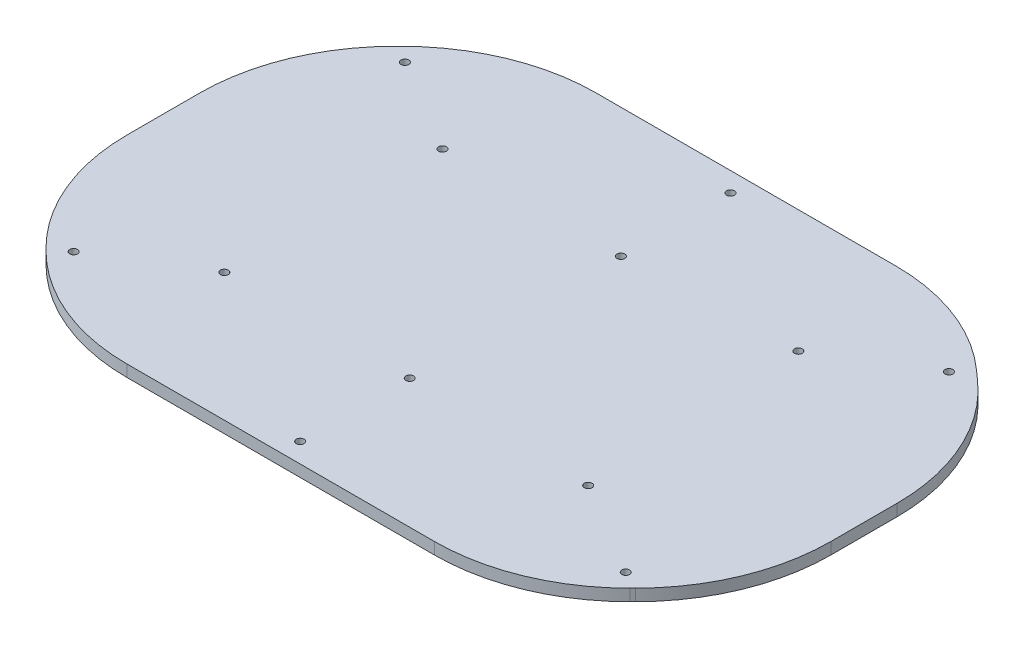
ISO-10303-21;
HEADER;
FILE_DESCRIPTION(('STEP AP214'),'2;1');
FILE_NAME('part.step','',(''),(''),'','','');
FILE_SCHEMA(('AUTOMOTIVE_DESIGN { 1 0 10303 214 1 1 1 1 }'));
ENDSEC;
DATA;
#1=APPLICATION_CONTEXT('core data for automotive mechanical design processes');
#2=APPLICATION_PROTOCOL_DEFINITION('international standard','automotive_design',2000,#1);
#3=PRODUCT_CONTEXT('',#1,'mechanical');
#4=PRODUCT('Part','Part','',(#3));
#5=PRODUCT_RELATED_PRODUCT_CATEGORY('part','',(#4));
#6=PRODUCT_DEFINITION_FORMATION('','',#4);
#7=PRODUCT_DEFINITION_CONTEXT('part definition',#1,'design');
#8=PRODUCT_DEFINITION('design','',#6,#7);
#9=PRODUCT_DEFINITION_SHAPE('','',#8);
#10=(LENGTH_UNIT() NAMED_UNIT(*) SI_UNIT(.MILLI.,.METRE.));
#11=(NAMED_UNIT(*) PLANE_ANGLE_UNIT() SI_UNIT($,.RADIAN.));
#12=(NAMED_UNIT(*) SI_UNIT($,.STERADIAN.) SOLID_ANGLE_UNIT());
#13=UNCERTAINTY_MEASURE_WITH_UNIT(LENGTH_MEASURE(1.E-05),#10,'distance_accuracy_value','');
#14=(GEOMETRIC_REPRESENTATION_CONTEXT(3) GLOBAL_UNCERTAINTY_ASSIGNED_CONTEXT((#13)) GLOBAL_UNIT_ASSIGNED_CONTEXT((#10,
#11,#12)) REPRESENTATION_CONTEXT('',''));
#15=CARTESIAN_POINT('',(0.,0.,0.));
#16=DIRECTION('',(0.,0.,1.));
#17=DIRECTION('',(1.,0.,0.));
#18=AXIS2_PLACEMENT_3D('',#15,#16,#17);
#19=CARTESIAN_POINT('',(77.0344992060901,3.,59.3831452297099));
#20=DIRECTION('',(0.,-1.,0.));
#21=DIRECTION('',(0.,0.,-1.));
#22=AXIS2_PLACEMENT_3D('',#19,#20,#21);
#23=CYLINDRICAL_SURFACE('',#22,49.9999999999996);
#24=CARTESIAN_POINT('',(77.0344992060901,0.,59.3831452297099));
#25=DIRECTION('',(0.,1.,0.));
#26=DIRECTION('',(0.,0.,1.));
#27=AXIS2_PLACEMENT_3D('',#24,#25,#26);
#28=CIRCLE('',#27,49.9999999999996);
#29=CARTESIAN_POINT('',(27.0344992060906,0.,59.3831452297099));
#30=VERTEX_POINT('',#29);
#31=CARTESIAN_POINT('',(41.679160146763,0.,24.0278061703827));
#32=VERTEX_POINT('',#31);
#33=EDGE_CURVE('E183',#30,#32,#28,.F.);
#34=ORIENTED_EDGE('',*,*,#33,.F.);
#35=DIRECTION('',(0.,-1.,0.));
#36=VECTOR('',#35,1.);
#37=CARTESIAN_POINT('',(27.0344992060906,3.,59.3831452297099));
#38=LINE('',#37,#36);
#39=CARTESIAN_POINT('',(27.0344992060906,3.,59.3831452297099));
#40=VERTEX_POINT('',#39);
#41=EDGE_CURVE('E11',#40,#30,#38,.T.);
#42=ORIENTED_EDGE('',*,*,#41,.F.);
#43=CARTESIAN_POINT('',(77.0344992060901,3.,59.3831452297099));
#44=DIRECTION('',(0.,1.,0.));
#45=DIRECTION('',(0.,0.,1.));
#46=AXIS2_PLACEMENT_3D('',#43,#44,#45);
#47=CIRCLE('',#46,49.9999999999996);
#48=CARTESIAN_POINT('',(41.679160146763,3.,24.0278061703827));
#49=VERTEX_POINT('',#48);
#50=EDGE_CURVE('E227',#40,#49,#47,.F.);
#51=ORIENTED_EDGE('',*,*,#50,.T.);
#52=DIRECTION('',(0.,-1.,0.));
#53=VECTOR('',#52,1.);
#54=CARTESIAN_POINT('',(41.679160146763,3.,24.0278061703827));
#55=LINE('',#54,#53);
#56=EDGE_CURVE('E57',#49,#32,#55,.T.);
#57=ORIENTED_EDGE('',*,*,#56,.T.);
#58=EDGE_LOOP('',(#34,#42,#51,#57));
#59=FACE_BOUND('',#58,.T.);
#60=ADVANCED_FACE('F41',(#59),#23,.T.);
#61=CARTESIAN_POINT('',(27.0344992060906,3.,0.));
#62=DIRECTION('',(1.,0.,0.));
#63=DIRECTION('',(0.,0.,-1.));
#64=AXIS2_PLACEMENT_3D('',#61,#62,#63);
#65=PLANE('',#64);
#66=DIRECTION('',(0.,0.,1.));
#67=VECTOR('',#66,1.);
#68=CARTESIAN_POINT('',(27.0344992060906,0.,0.));
#69=LINE('',#68,#67);
#70=CARTESIAN_POINT('',(27.0344992060906,0.,77.9617889924004));
#71=VERTEX_POINT('',#70);
#72=EDGE_CURVE('E185',#30,#71,#69,.T.);
#73=ORIENTED_EDGE('',*,*,#72,.T.);
#74=DIRECTION('',(0.,-1.,0.));
#75=VECTOR('',#74,1.);
#76=CARTESIAN_POINT('',(27.0344992060906,3.,77.9617889924004));
#77=LINE('',#76,#75);
#78=CARTESIAN_POINT('',(27.0344992060906,3.,77.9617889924004));
#79=VERTEX_POINT('',#78);
#80=EDGE_CURVE('E49',#79,#71,#77,.T.);
#81=ORIENTED_EDGE('',*,*,#80,.F.);
#82=DIRECTION('',(0.,0.,1.));
#83=VECTOR('',#82,1.);
#84=CARTESIAN_POINT('',(27.0344992060906,3.,0.));
#85=LINE('',#84,#83);
#86=EDGE_CURVE('E273',#40,#79,#85,.T.);
#87=ORIENTED_EDGE('',*,*,#86,.F.);
#88=ORIENTED_EDGE('',*,*,#41,.T.);
#89=EDGE_LOOP('',(#73,#81,#87,#88));
#90=FACE_BOUND('',#89,.T.);
#91=ADVANCED_FACE('F260',(#90),#65,.F.);
#92=CARTESIAN_POINT('',(77.0344992060901,3.,77.9617889924004));
#93=DIRECTION('',(0.,-1.,0.));
#94=DIRECTION('',(0.,0.,-1.));
#95=AXIS2_PLACEMENT_3D('',#92,#93,#94);
#96=CYLINDRICAL_SURFACE('',#95,49.9999999999996);
#97=CARTESIAN_POINT('',(77.0344992060901,0.,77.9617889924004));
#98=DIRECTION('',(0.,1.,0.));
#99=DIRECTION('',(0.,0.,1.));
#100=AXIS2_PLACEMENT_3D('',#97,#98,#99);
#101=CIRCLE('',#100,49.9999999999996);
#102=CARTESIAN_POINT('',(41.6791601467634,0.,113.317128051728));
#103=VERTEX_POINT('',#102);
#104=EDGE_CURVE('E189',#103,#71,#101,.F.);
#105=ORIENTED_EDGE('',*,*,#104,.F.);
#106=DIRECTION('',(0.,-1.,0.));
#107=VECTOR('',#106,1.);
#108=CARTESIAN_POINT('',(41.6791601467634,3.,113.317128051728));
#109=LINE('',#108,#107);
#110=CARTESIAN_POINT('',(41.6791601467634,3.,113.317128051728));
#111=VERTEX_POINT('',#110);
#112=EDGE_CURVE('E250',#111,#103,#109,.T.);
#113=ORIENTED_EDGE('',*,*,#112,.F.);
#114=CARTESIAN_POINT('',(77.0344992060901,3.,77.9617889924004));
#115=DIRECTION('',(0.,1.,0.));
#116=DIRECTION('',(0.,0.,1.));
#117=AXIS2_PLACEMENT_3D('',#114,#115,#116);
#118=CIRCLE('',#117,49.9999999999996);
#119=EDGE_CURVE('E257',#111,#79,#118,.F.);
#120=ORIENTED_EDGE('',*,*,#119,.T.);
#121=ORIENTED_EDGE('',*,*,#80,.T.);
#122=EDGE_LOOP('',(#105,#113,#120,#121));
#123=FACE_BOUND('',#122,.T.);
#124=ADVANCED_FACE('F255',(#123),#96,.T.);
#125=CARTESIAN_POINT('',(-35.8189839524827,3.,35.8189839524834));
#126=DIRECTION('',(-0.707106781186541,0.,0.707106781186554));
#127=DIRECTION('',(0.707106781186554,0.,0.707106781186541));
#128=AXIS2_PLACEMENT_3D('',#125,#126,#127);
#129=PLANE('',#128);
#130=DIRECTION('',(-0.707106781186554,0.,-0.707106781186541));
#131=VECTOR('',#130,1.);
#132=CARTESIAN_POINT('',(-35.8189839524827,0.,35.8189839524834));
#133=LINE('',#132,#131);
#134=CARTESIAN_POINT('',(42.3898382654183,0.,114.027806170383));
#135=VERTEX_POINT('',#134);
#136=EDGE_CURVE('E192',#135,#103,#133,.T.);
#137=ORIENTED_EDGE('',*,*,#136,.F.);
#138=DIRECTION('',(0.,-1.,0.));
#139=VECTOR('',#138,1.);
#140=CARTESIAN_POINT('',(42.3898382654183,3.,114.027806170383));
#141=LINE('',#140,#139);
#142=CARTESIAN_POINT('',(42.3898382654183,3.,114.027806170383));
#143=VERTEX_POINT('',#142);
#144=EDGE_CURVE('E248',#143,#135,#141,.T.);
#145=ORIENTED_EDGE('',*,*,#144,.F.);
#146=DIRECTION('',(-0.707106781186554,0.,-0.707106781186541));
#147=VECTOR('',#146,1.);
#148=CARTESIAN_POINT('',(-35.8189839524827,3.,35.8189839524834));
#149=LINE('',#148,#147);
#150=EDGE_CURVE('E270',#143,#111,#149,.T.);
#151=ORIENTED_EDGE('',*,*,#150,.T.);
#152=ORIENTED_EDGE('',*,*,#112,.T.);
#153=EDGE_LOOP('',(#137,#145,#151,#152));
#154=FACE_BOUND('',#153,.T.);
#155=ADVANCED_FACE('F267',(#154),#129,.T.);
#156=CARTESIAN_POINT('',(77.7451773247451,3.,78.6724671110553));
#157=DIRECTION('',(0.,-1.,0.));
#158=DIRECTION('',(0.,0.,-1.));
#159=AXIS2_PLACEMENT_3D('',#156,#157,#158);
#160=CYLINDRICAL_SURFACE('',#159,49.9999999999999);
#161=CARTESIAN_POINT('',(77.7451773247451,0.,78.6724671110553));
#162=DIRECTION('',(0.,1.,0.));
#163=DIRECTION('',(0.,0.,1.));
#164=AXIS2_PLACEMENT_3D('',#161,#162,#163);
#165=CIRCLE('',#164,49.9999999999999);
#166=CARTESIAN_POINT('',(77.7451773247455,0.,128.672467111055));
#167=VERTEX_POINT('',#166);
#168=EDGE_CURVE('E195',#167,#135,#165,.F.);
#169=ORIENTED_EDGE('',*,*,#168,.F.);
#170=DIRECTION('',(0.,-1.,0.));
#171=VECTOR('',#170,1.);
#172=CARTESIAN_POINT('',(77.7451773247455,3.,128.672467111055));
#173=LINE('',#172,#171);
#174=CARTESIAN_POINT('',(77.7451773247455,3.,128.672467111055));
#175=VERTEX_POINT('',#174);
#176=EDGE_CURVE('E246',#175,#167,#173,.T.);
#177=ORIENTED_EDGE('',*,*,#176,.F.);
#178=CARTESIAN_POINT('',(77.7451773247451,3.,78.6724671110553));
#179=DIRECTION('',(0.,1.,0.));
#180=DIRECTION('',(0.,0.,1.));
#181=AXIS2_PLACEMENT_3D('',#178,#179,#180);
#182=CIRCLE('',#181,49.9999999999999);
#183=EDGE_CURVE('E275',#175,#143,#182,.F.);
#184=ORIENTED_EDGE('',*,*,#183,.T.);
#185=ORIENTED_EDGE('',*,*,#144,.T.);
#186=EDGE_LOOP('',(#169,#177,#184,#185));
#187=FACE_BOUND('',#186,.T.);
#188=ADVANCED_FACE('F324',(#187),#160,.T.);
#189=CARTESIAN_POINT('',(0.,3.,128.672467111055));
#190=DIRECTION('',(0.,0.,-1.));
#191=DIRECTION('',(-1.,0.,0.));
#192=AXIS2_PLACEMENT_3D('',#189,#190,#191);
#193=PLANE('',#192);
#194=DIRECTION('',(1.,0.,0.));
#195=VECTOR('',#194,1.);
#196=CARTESIAN_POINT('',(0.,0.,128.672467111055));
#197=LINE('',#196,#195);
#198=CARTESIAN_POINT('',(156.323821087436,0.,128.672467111055));
#199=VERTEX_POINT('',#198);
#200=EDGE_CURVE('E198',#167,#199,#197,.T.);
#201=ORIENTED_EDGE('',*,*,#200,.T.);
#202=DIRECTION('',(0.,-1.,0.));
#203=VECTOR('',#202,1.);
#204=CARTESIAN_POINT('',(156.323821087436,3.,128.672467111055));
#205=LINE('',#204,#203);
#206=CARTESIAN_POINT('',(156.323821087436,3.,128.672467111055));
#207=VERTEX_POINT('',#206);
#208=EDGE_CURVE('E243',#207,#199,#205,.T.);
#209=ORIENTED_EDGE('',*,*,#208,.F.);
#210=DIRECTION('',(1.,0.,0.));
#211=VECTOR('',#210,1.);
#212=CARTESIAN_POINT('',(0.,3.,128.672467111055));
#213=LINE('',#212,#211);
#214=EDGE_CURVE('E281',#175,#207,#213,.T.);
#215=ORIENTED_EDGE('',*,*,#214,.F.);
#216=ORIENTED_EDGE('',*,*,#176,.T.);
#217=EDGE_LOOP('',(#201,#209,#215,#216));
#218=FACE_BOUND('',#217,.T.);
#219=ADVANCED_FACE('F327',(#218),#193,.F.);
#220=CARTESIAN_POINT('',(156.323821087435,3.,78.6724671110553));
#221=DIRECTION('',(0.,-1.,0.));
#222=DIRECTION('',(0.,0.,-1.));
#223=AXIS2_PLACEMENT_3D('',#220,#221,#222);
#224=CYLINDRICAL_SURFACE('',#223,50.0000000000001);
#225=CARTESIAN_POINT('',(156.323821087435,0.,78.6724671110553));
#226=DIRECTION('',(0.,1.,0.));
#227=DIRECTION('',(0.,0.,1.));
#228=AXIS2_PLACEMENT_3D('',#225,#226,#227);
#229=CIRCLE('',#228,50.0000000000001);
#230=CARTESIAN_POINT('',(191.679160146763,0.,114.027806170383));
#231=VERTEX_POINT('',#230);
#232=EDGE_CURVE('E200',#199,#231,#229,.T.);
#233=ORIENTED_EDGE('',*,*,#232,.T.);
#234=DIRECTION('',(0.,-1.,0.));
#235=VECTOR('',#234,1.);
#236=CARTESIAN_POINT('',(191.679160146763,3.,114.027806170383));
#237=LINE('',#236,#235);
#238=CARTESIAN_POINT('',(191.679160146763,3.,114.027806170383));
#239=VERTEX_POINT('',#238);
#240=EDGE_CURVE('E241',#239,#231,#237,.T.);
#241=ORIENTED_EDGE('',*,*,#240,.F.);
#242=CARTESIAN_POINT('',(156.323821087435,3.,78.6724671110553));
#243=DIRECTION('',(0.,1.,0.));
#244=DIRECTION('',(0.,0.,1.));
#245=AXIS2_PLACEMENT_3D('',#242,#243,#244);
#246=CIRCLE('',#245,50.0000000000001);
#247=EDGE_CURVE('E283',#207,#239,#246,.T.);
#248=ORIENTED_EDGE('',*,*,#247,.F.);
#249=ORIENTED_EDGE('',*,*,#208,.T.);
#250=EDGE_LOOP('',(#233,#241,#248,#249));
#251=FACE_BOUND('',#250,.T.);
#252=ADVANCED_FACE('F331',(#251),#224,.T.);
#253=CARTESIAN_POINT('',(152.853483158573,3.,152.853483158573));
#254=DIRECTION('',(0.707106781186547,0.,0.707106781186547));
#255=DIRECTION('',(0.707106781186548,0.,-0.707106781186548));
#256=AXIS2_PLACEMENT_3D('',#253,#254,#255);
#257=PLANE('',#256);
#258=DIRECTION('',(-0.707106781186548,0.,0.707106781186548));
#259=VECTOR('',#258,1.);
#260=CARTESIAN_POINT('',(152.853483158573,0.,152.853483158573));
#261=LINE('',#260,#259);
#262=CARTESIAN_POINT('',(192.389838265418,0.,113.317128051728));
#263=VERTEX_POINT('',#262);
#264=EDGE_CURVE('E203',#263,#231,#261,.T.);
#265=ORIENTED_EDGE('',*,*,#264,.F.);
#266=DIRECTION('',(0.,-1.,0.));
#267=VECTOR('',#266,1.);
#268=CARTESIAN_POINT('',(192.389838265418,3.,113.317128051728));
#269=LINE('',#268,#267);
#270=CARTESIAN_POINT('',(192.389838265418,3.,113.317128051728));
#271=VERTEX_POINT('',#270);
#272=EDGE_CURVE('E239',#271,#263,#269,.T.);
#273=ORIENTED_EDGE('',*,*,#272,.F.);
#274=DIRECTION('',(-0.707106781186548,0.,0.707106781186548));
#275=VECTOR('',#274,1.);
#276=CARTESIAN_POINT('',(152.853483158573,3.,152.853483158573));
#277=LINE('',#276,#275);
#278=EDGE_CURVE('E285',#271,#239,#277,.T.);
#279=ORIENTED_EDGE('',*,*,#278,.T.);
#280=ORIENTED_EDGE('',*,*,#240,.T.);
#281=EDGE_LOOP('',(#265,#273,#279,#280));
#282=FACE_BOUND('',#281,.T.);
#283=ADVANCED_FACE('F335',(#282),#257,.T.);
#284=CARTESIAN_POINT('',(157.03449920609,3.,77.9617889924004));
#285=DIRECTION('',(0.,-1.,0.));
#286=DIRECTION('',(0.,0.,-1.));
#287=AXIS2_PLACEMENT_3D('',#284,#285,#286);
#288=CYLINDRICAL_SURFACE('',#287,50.0000000000003);
#289=CARTESIAN_POINT('',(157.03449920609,0.,77.9617889924004));
#290=DIRECTION('',(0.,1.,0.));
#291=DIRECTION('',(0.,0.,1.));
#292=AXIS2_PLACEMENT_3D('',#289,#290,#291);
#293=CIRCLE('',#292,50.0000000000003);
#294=CARTESIAN_POINT('',(207.034499206091,0.,77.9617889924004));
#295=VERTEX_POINT('',#294);
#296=EDGE_CURVE('E206',#263,#295,#293,.T.);
#297=ORIENTED_EDGE('',*,*,#296,.T.);
#298=DIRECTION('',(0.,-1.,0.));
#299=VECTOR('',#298,1.);
#300=CARTESIAN_POINT('',(207.034499206091,3.,77.9617889924004));
#301=LINE('',#300,#299);
#302=CARTESIAN_POINT('',(207.034499206091,3.,77.9617889924004));
#303=VERTEX_POINT('',#302);
#304=EDGE_CURVE('E237',#303,#295,#301,.T.);
#305=ORIENTED_EDGE('',*,*,#304,.F.);
#306=CARTESIAN_POINT('',(157.03449920609,3.,77.9617889924004));
#307=DIRECTION('',(0.,1.,0.));
#308=DIRECTION('',(0.,0.,1.));
#309=AXIS2_PLACEMENT_3D('',#306,#307,#308);
#310=CIRCLE('',#309,50.0000000000003);
#311=EDGE_CURVE('E288',#271,#303,#310,.T.);
#312=ORIENTED_EDGE('',*,*,#311,.F.);
#313=ORIENTED_EDGE('',*,*,#272,.T.);
#314=EDGE_LOOP('',(#297,#305,#312,#313));
#315=FACE_BOUND('',#314,.T.);
#316=ADVANCED_FACE('F339',(#315),#288,.T.);
#317=CARTESIAN_POINT('',(207.034499206089,3.,-5.10107634850163E-12));
#318=DIRECTION('',(1.,0.,0.));
#319=DIRECTION('',(0.,0.,-1.));
#320=AXIS2_PLACEMENT_3D('',#317,#318,#319);
#321=PLANE('',#320);
#322=DIRECTION('',(0.,0.,1.));
#323=VECTOR('',#322,1.);
#324=CARTESIAN_POINT('',(207.034499206089,0.,-5.10107634850163E-12));
#325=LINE('',#324,#323);
#326=CARTESIAN_POINT('',(207.03449920609,0.,61.0642913708062));
#327=VERTEX_POINT('',#326);
#328=EDGE_CURVE('E209',#327,#295,#325,.T.);
#329=ORIENTED_EDGE('',*,*,#328,.F.);
#330=DIRECTION('',(0.,-1.,0.));
#331=VECTOR('',#330,1.);
#332=CARTESIAN_POINT('',(207.03449920609,3.,61.0642913708062));
#333=LINE('',#332,#331);
#334=CARTESIAN_POINT('',(207.03449920609,3.,61.0642913708062));
#335=VERTEX_POINT('',#334);
#336=EDGE_CURVE('E235',#335,#327,#333,.T.);
#337=ORIENTED_EDGE('',*,*,#336,.F.);
#338=DIRECTION('',(0.,0.,1.));
#339=VECTOR('',#338,1.);
#340=CARTESIAN_POINT('',(207.034499206089,3.,-5.10107634850163E-12));
#341=LINE('',#340,#339);
#342=EDGE_CURVE('E290',#335,#303,#341,.T.);
#343=ORIENTED_EDGE('',*,*,#342,.T.);
#344=ORIENTED_EDGE('',*,*,#304,.T.);
#345=EDGE_LOOP('',(#329,#337,#343,#344));
#346=FACE_BOUND('',#345,.T.);
#347=ADVANCED_FACE('F343',(#346),#321,.T.);
#348=CARTESIAN_POINT('',(157.03449920609,3.,61.0642913708062));
#349=DIRECTION('',(0.,-1.,0.));
#350=DIRECTION('',(0.,0.,-1.));
#351=AXIS2_PLACEMENT_3D('',#348,#349,#350);
#352=CYLINDRICAL_SURFACE('',#351,50.);
#353=CARTESIAN_POINT('',(157.03449920609,0.,61.0642913708062));
#354=DIRECTION('',(0.,1.,0.));
#355=DIRECTION('',(0.,0.,1.));
#356=AXIS2_PLACEMENT_3D('',#353,#354,#355);
#357=CIRCLE('',#356,50.);
#358=CARTESIAN_POINT('',(190.329134027571,0.,23.7619148767515));
#359=VERTEX_POINT('',#358);
#360=EDGE_CURVE('E212',#359,#327,#357,.F.);
#361=ORIENTED_EDGE('',*,*,#360,.F.);
#362=DIRECTION('',(0.,-1.,0.));
#363=VECTOR('',#362,1.);
#364=CARTESIAN_POINT('',(190.329134027571,3.,23.7619148767515));
#365=LINE('',#364,#363);
#366=CARTESIAN_POINT('',(190.329134027571,3.,23.7619148767515));
#367=VERTEX_POINT('',#366);
#368=EDGE_CURVE('E233',#367,#359,#365,.T.);
#369=ORIENTED_EDGE('',*,*,#368,.F.);
#370=CARTESIAN_POINT('',(157.03449920609,3.,61.0642913708062));
#371=DIRECTION('',(0.,1.,0.));
#372=DIRECTION('',(0.,0.,1.));
#373=AXIS2_PLACEMENT_3D('',#370,#371,#372);
#374=CIRCLE('',#373,50.);
#375=EDGE_CURVE('E293',#367,#335,#374,.F.);
#376=ORIENTED_EDGE('',*,*,#375,.T.);
#377=ORIENTED_EDGE('',*,*,#336,.T.);
#378=EDGE_LOOP('',(#361,#369,#376,#377));
#379=FACE_BOUND('',#378,.T.);
#380=ADVANCED_FACE('F347',(#379),#352,.T.);
#381=CARTESIAN_POINT('',(72.5898034392166,3.,-81.3275830186345));
#382=DIRECTION('',(0.665892696429618,0.,-0.746047529881101));
#383=DIRECTION('',(-0.746047529881101,0.,-0.665892696429618));
#384=AXIS2_PLACEMENT_3D('',#381,#382,#383);
#385=PLANE('',#384);
#386=DIRECTION('',(0.746047529881101,0.,0.665892696429618));
#387=VECTOR('',#386,1.);
#388=CARTESIAN_POINT('',(72.5898034392166,0.,-81.3275830186345));
#389=LINE('',#388,#387);
#390=CARTESIAN_POINT('',(187.649401105939,0.,21.3700906170007));
#391=VERTEX_POINT('',#390);
#392=EDGE_CURVE('E215',#391,#359,#389,.T.);
#393=ORIENTED_EDGE('',*,*,#392,.F.);
#394=DIRECTION('',(0.,-1.,0.));
#395=VECTOR('',#394,1.);
#396=CARTESIAN_POINT('',(187.649401105939,3.,21.3700906170007));
#397=LINE('',#396,#395);
#398=CARTESIAN_POINT('',(187.649401105939,3.,21.3700906170007));
#399=VERTEX_POINT('',#398);
#400=EDGE_CURVE('E231',#399,#391,#397,.T.);
#401=ORIENTED_EDGE('',*,*,#400,.F.);
#402=DIRECTION('',(0.746047529881101,0.,0.665892696429618));
#403=VECTOR('',#402,1.);
#404=CARTESIAN_POINT('',(72.5898034392166,3.,-81.3275830186345));
#405=LINE('',#404,#403);
#406=EDGE_CURVE('E296',#399,#367,#405,.T.);
#407=ORIENTED_EDGE('',*,*,#406,.T.);
#408=ORIENTED_EDGE('',*,*,#368,.T.);
#409=EDGE_LOOP('',(#393,#401,#407,#408));
#410=FACE_BOUND('',#409,.T.);
#411=ADVANCED_FACE('F351',(#410),#385,.T.);
#412=CARTESIAN_POINT('',(154.354766284458,3.,58.6724671110553));
#413=DIRECTION('',(0.,-1.,0.));
#414=DIRECTION('',(0.,0.,-1.));
#415=AXIS2_PLACEMENT_3D('',#412,#413,#414);
#416=CYLINDRICAL_SURFACE('',#415,50.);
#417=CARTESIAN_POINT('',(154.354766284458,0.,58.6724671110553));
#418=DIRECTION('',(0.,1.,0.));
#419=DIRECTION('',(0.,0.,1.));
#420=AXIS2_PLACEMENT_3D('',#417,#418,#419);
#421=CIRCLE('',#420,50.);
#422=CARTESIAN_POINT('',(154.354766284458,0.,8.67246711105527));
#423=VERTEX_POINT('',#422);
#424=EDGE_CURVE('E218',#423,#391,#421,.F.);
#425=ORIENTED_EDGE('',*,*,#424,.F.);
#426=DIRECTION('',(0.,-1.,0.));
#427=VECTOR('',#426,1.);
#428=CARTESIAN_POINT('',(154.354766284458,3.,8.67246711105527));
#429=LINE('',#428,#427);
#430=CARTESIAN_POINT('',(154.354766284458,3.,8.67246711105527));
#431=VERTEX_POINT('',#430);
#432=EDGE_CURVE('E164',#431,#423,#429,.T.);
#433=ORIENTED_EDGE('',*,*,#432,.F.);
#434=CARTESIAN_POINT('',(154.354766284458,3.,58.6724671110553));
#435=DIRECTION('',(0.,1.,0.));
#436=DIRECTION('',(0.,0.,1.));
#437=AXIS2_PLACEMENT_3D('',#434,#435,#436);
#438=CIRCLE('',#437,50.);
#439=EDGE_CURVE('E175',#431,#399,#438,.F.);
#440=ORIENTED_EDGE('',*,*,#439,.T.);
#441=ORIENTED_EDGE('',*,*,#400,.T.);
#442=EDGE_LOOP('',(#425,#433,#440,#441));
#443=FACE_BOUND('',#442,.T.);
#444=ADVANCED_FACE('F300',(#443),#416,.T.);
#445=CARTESIAN_POINT('',(0.,3.,8.67246711105532));
#446=DIRECTION('',(0.,0.,-1.));
#447=DIRECTION('',(-1.,0.,0.));
#448=AXIS2_PLACEMENT_3D('',#445,#446,#447);
#449=PLANE('',#448);
#450=DIRECTION('',(1.,0.,0.));
#451=VECTOR('',#450,1.);
#452=CARTESIAN_POINT('',(0.,0.,8.67246711105532));
#453=LINE('',#452,#451);
#454=CARTESIAN_POINT('',(77.7451773247452,0.,8.67246711105529));
#455=VERTEX_POINT('',#454);
#456=EDGE_CURVE('E160',#455,#423,#453,.T.);
#457=ORIENTED_EDGE('',*,*,#456,.F.);
#458=DIRECTION('',(0.,-1.,0.));
#459=VECTOR('',#458,1.);
#460=CARTESIAN_POINT('',(77.7451773247452,3.,8.67246711105529));
#461=LINE('',#460,#459);
#462=CARTESIAN_POINT('',(77.7451773247452,3.,8.67246711105529));
#463=VERTEX_POINT('',#462);
#464=EDGE_CURVE('E155',#463,#455,#461,.T.);
#465=ORIENTED_EDGE('',*,*,#464,.F.);
#466=DIRECTION('',(1.,0.,0.));
#467=VECTOR('',#466,1.);
#468=CARTESIAN_POINT('',(0.,3.,8.67246711105532));
#469=LINE('',#468,#467);
#470=EDGE_CURVE('E158',#463,#431,#469,.T.);
#471=ORIENTED_EDGE('',*,*,#470,.T.);
#472=ORIENTED_EDGE('',*,*,#432,.T.);
#473=EDGE_LOOP('',(#457,#465,#471,#472));
#474=FACE_BOUND('',#473,.T.);
#475=ADVANCED_FACE('F157',(#474),#449,.T.);
#476=CARTESIAN_POINT('',(77.7451773247447,3.,58.6724671110553));
#477=DIRECTION('',(0.,-1.,0.));
#478=DIRECTION('',(0.,0.,-1.));
#479=AXIS2_PLACEMENT_3D('',#476,#477,#478);
#480=CYLINDRICAL_SURFACE('',#479,49.9999999999998);
#481=CARTESIAN_POINT('',(77.7451773247447,0.,58.6724671110553));
#482=DIRECTION('',(0.,1.,0.));
#483=DIRECTION('',(0.,0.,1.));
#484=AXIS2_PLACEMENT_3D('',#481,#482,#483);
#485=CIRCLE('',#484,49.9999999999998);
#486=CARTESIAN_POINT('',(42.3898382654176,0.,23.3171280517281));
#487=VERTEX_POINT('',#486);
#488=EDGE_CURVE('E222',#487,#455,#485,.F.);
#489=ORIENTED_EDGE('',*,*,#488,.F.);
#490=DIRECTION('',(0.,-1.,0.));
#491=VECTOR('',#490,1.);
#492=CARTESIAN_POINT('',(42.3898382654176,3.,23.3171280517281));
#493=LINE('',#492,#491);
#494=CARTESIAN_POINT('',(42.3898382654176,3.,23.3171280517281));
#495=VERTEX_POINT('',#494);
#496=EDGE_CURVE('E106',#495,#487,#493,.T.);
#497=ORIENTED_EDGE('',*,*,#496,.F.);
#498=CARTESIAN_POINT('',(77.7451773247447,3.,58.6724671110553));
#499=DIRECTION('',(0.,1.,0.));
#500=DIRECTION('',(0.,0.,1.));
#501=AXIS2_PLACEMENT_3D('',#498,#499,#500);
#502=CIRCLE('',#501,49.9999999999998);
#503=EDGE_CURVE('E172',#495,#463,#502,.F.);
#504=ORIENTED_EDGE('',*,*,#503,.T.);
#505=ORIENTED_EDGE('',*,*,#464,.T.);
#506=EDGE_LOOP('',(#489,#497,#504,#505));
#507=FACE_BOUND('',#506,.T.);
#508=ADVANCED_FACE('F177',(#507),#480,.T.);
#509=CARTESIAN_POINT('',(32.8534831585733,3.,32.8534831585726));
#510=DIRECTION('',(-0.707106781186554,0.,-0.707106781186541));
#511=DIRECTION('',(-0.707106781186541,0.,0.707106781186554));
#512=AXIS2_PLACEMENT_3D('',#509,#510,#511);
#513=PLANE('',#512);
#514=DIRECTION('',(0.707106781186541,0.,-0.707106781186554));
#515=VECTOR('',#514,1.);
#516=CARTESIAN_POINT('',(32.8534831585733,0.,32.8534831585726));
#517=LINE('',#516,#515);
#518=EDGE_CURVE('E224',#32,#487,#517,.T.);
#519=ORIENTED_EDGE('',*,*,#518,.F.);
#520=ORIENTED_EDGE('',*,*,#56,.F.);
#521=DIRECTION('',(0.707106781186541,0.,-0.707106781186554));
#522=VECTOR('',#521,1.);
#523=CARTESIAN_POINT('',(32.8534831585733,3.,32.8534831585726));
#524=LINE('',#523,#522);
#525=EDGE_CURVE('E178',#49,#495,#524,.T.);
#526=ORIENTED_EDGE('',*,*,#525,.T.);
#527=ORIENTED_EDGE('',*,*,#496,.T.);
#528=EDGE_LOOP('',(#519,#520,#526,#527));
#529=FACE_BOUND('',#528,.T.);
#530=ADVANCED_FACE('F302',(#529),#513,.T.);
#531=CARTESIAN_POINT('',(0.,3.,0.));
#532=DIRECTION('',(0.,1.,0.));
#533=DIRECTION('',(0.,0.,1.));
#534=AXIS2_PLACEMENT_3D('',#531,#532,#533);
#535=PLANE('',#534);
#536=CARTESIAN_POINT('',(160.707496688182,3.,39.9891285445304));
#537=DIRECTION('',(0.,1.,0.));
#538=DIRECTION('',(0.,0.,1.));
#539=AXIS2_PLACEMENT_3D('',#536,#537,#538);
#540=CIRCLE('',#539,0.999999999999998);
#541=CARTESIAN_POINT('',(160.707496688182,3.,40.9891285445304));
#542=VERTEX_POINT('',#541);
#543=EDGE_CURVE('E517',#542,#542,#540,.T.);
#544=ORIENTED_EDGE('',*,*,#543,.F.);
#545=EDGE_LOOP('',(#544));
#546=FACE_BOUND('',#545,.T.);
#547=CARTESIAN_POINT('',(163.605279903723,3.,96.6149355296351));
#548=DIRECTION('',(0.,1.,0.));
#549=DIRECTION('',(0.,0.,1.));
#550=AXIS2_PLACEMENT_3D('',#547,#548,#549);
#551=CIRCLE('',#550,0.999999999997764);
#552=CARTESIAN_POINT('',(163.605279903723,3.,97.6149355296328));
#553=VERTEX_POINT('',#552);
#554=EDGE_CURVE('E523',#553,#553,#551,.T.);
#555=ORIENTED_EDGE('',*,*,#554,.F.);
#556=EDGE_LOOP('',(#555));
#557=FACE_BOUND('',#556,.T.);
#558=CARTESIAN_POINT('',(187.615081823674,3.,111.020816681606));
#559=DIRECTION('',(0.,1.,0.));
#560=DIRECTION('',(0.,0.,1.));
#561=AXIS2_PLACEMENT_3D('',#558,#559,#560);
#562=CIRCLE('',#561,0.999999999999647);
#563=CARTESIAN_POINT('',(187.615081823674,3.,112.020816681605));
#564=VERTEX_POINT('',#563);
#565=EDGE_CURVE('E534',#564,#564,#562,.T.);
#566=ORIENTED_EDGE('',*,*,#565,.F.);
#567=EDGE_LOOP('',(#566));
#568=FACE_BOUND('',#567,.T.);
#569=CARTESIAN_POINT('',(117.034499206091,3.,95.6724671110553));
#570=DIRECTION('',(0.,1.,0.));
#571=DIRECTION('',(0.,0.,1.));
#572=AXIS2_PLACEMENT_3D('',#569,#570,#571);
#573=CIRCLE('',#572,0.999999999999998);
#574=CARTESIAN_POINT('',(117.034499206091,3.,96.6724671110553));
#575=VERTEX_POINT('',#574);
#576=EDGE_CURVE('E600',#575,#575,#573,.T.);
#577=ORIENTED_EDGE('',*,*,#576,.F.);
#578=EDGE_LOOP('',(#577));
#579=FACE_BOUND('',#578,.T.);
#580=CARTESIAN_POINT('',(46.4539165885062,3.,26.324117540505));
#581=DIRECTION('',(0.,1.,0.));
#582=DIRECTION('',(0.,0.,1.));
#583=AXIS2_PLACEMENT_3D('',#580,#581,#582);
#584=CIRCLE('',#583,1.00000000000001);
#585=CARTESIAN_POINT('',(46.4539165885062,3.,27.324117540505));
#586=VERTEX_POINT('',#585);
#587=EDGE_CURVE('E544',#586,#586,#584,.T.);
#588=ORIENTED_EDGE('',*,*,#587,.F.);
#589=EDGE_LOOP('',(#588));
#590=FACE_BOUND('',#589,.T.);
#591=CARTESIAN_POINT('',(117.034499206091,3.,41.6724671110553));
#592=DIRECTION('',(0.,1.,0.));
#593=DIRECTION('',(0.,0.,1.));
#594=AXIS2_PLACEMENT_3D('',#591,#592,#593);
#595=CIRCLE('',#594,0.999999999999998);
#596=CARTESIAN_POINT('',(117.034499206091,3.,42.6724671110553));
#597=VERTEX_POINT('',#596);
#598=EDGE_CURVE('E551',#597,#597,#595,.T.);
#599=ORIENTED_EDGE('',*,*,#598,.F.);
#600=EDGE_LOOP('',(#599));
#601=FACE_BOUND('',#600,.T.);
#602=CARTESIAN_POINT('',(184.546793577318,3.,25.3028109723261));
#603=DIRECTION('',(0.,1.,0.));
#604=DIRECTION('',(0.,0.,1.));
#605=AXIS2_PLACEMENT_3D('',#602,#603,#604);
#606=CIRCLE('',#605,0.999999999999998);
#607=CARTESIAN_POINT('',(184.546793577318,3.,26.3028109723261));
#608=VERTEX_POINT('',#607);
#609=EDGE_CURVE('E535',#608,#608,#606,.T.);
#610=ORIENTED_EDGE('',*,*,#609,.F.);
#611=EDGE_LOOP('',(#610));
#612=FACE_BOUND('',#611,.T.);
#613=CARTESIAN_POINT('',(117.034499206091,3.,13.6724671110553));
#614=DIRECTION('',(0.,1.,0.));
#615=DIRECTION('',(0.,0.,1.));
#616=AXIS2_PLACEMENT_3D('',#613,#614,#615);
#617=CIRCLE('',#616,0.999999999999998);
#618=CARTESIAN_POINT('',(117.034499206091,3.,14.6724671110553));
#619=VERTEX_POINT('',#618);
#620=EDGE_CURVE('E521',#619,#619,#617,.T.);
#621=ORIENTED_EDGE('',*,*,#620,.F.);
#622=EDGE_LOOP('',(#621));
#623=FACE_BOUND('',#622,.T.);
#624=CARTESIAN_POINT('',(117.034499206091,3.,123.672467111055));
#625=DIRECTION('',(0.,1.,0.));
#626=DIRECTION('',(0.,0.,1.));
#627=AXIS2_PLACEMENT_3D('',#624,#625,#626);
#628=CIRCLE('',#627,0.999999999999998);
#629=CARTESIAN_POINT('',(117.034499206091,3.,124.672467111055));
#630=VERTEX_POINT('',#629);
#631=EDGE_CURVE('E578',#630,#630,#628,.T.);
#632=ORIENTED_EDGE('',*,*,#631,.F.);
#633=EDGE_LOOP('',(#632));
#634=FACE_BOUND('',#633,.T.);
#635=CARTESIAN_POINT('',(46.0546720561044,3.,110.621572149203));
#636=DIRECTION('',(0.,1.,0.));
#637=DIRECTION('',(0.,0.,1.));
#638=AXIS2_PLACEMENT_3D('',#635,#636,#637);
#639=CIRCLE('',#638,1.0000000000001);
#640=CARTESIAN_POINT('',(46.0546720561044,3.,111.621572149204));
#641=VERTEX_POINT('',#640);
#642=EDGE_CURVE('E582',#641,#641,#639,.T.);
#643=ORIENTED_EDGE('',*,*,#642,.F.);
#644=EDGE_LOOP('',(#643));
#645=FACE_BOUND('',#644,.T.);
#646=CARTESIAN_POINT('',(69.8939689452402,3.,95.9352545769992));
#647=DIRECTION('',(0.,1.,0.));
#648=DIRECTION('',(0.,0.,1.));
#649=AXIS2_PLACEMENT_3D('',#646,#647,#648);
#650=CIRCLE('',#649,1.00000000000588);
#651=CARTESIAN_POINT('',(69.8939689452402,3.,96.935254577005));
#652=VERTEX_POINT('',#651);
#653=EDGE_CURVE('E585',#652,#652,#650,.T.);
#654=ORIENTED_EDGE('',*,*,#653,.F.);
#655=EDGE_LOOP('',(#654));
#656=FACE_BOUND('',#655,.T.);
#657=CARTESIAN_POINT('',(70.4637185084575,3.,40.7299986924757));
#658=DIRECTION('',(0.,1.,0.));
#659=DIRECTION('',(0.,0.,1.));
#660=AXIS2_PLACEMENT_3D('',#657,#658,#659);
#661=CIRCLE('',#660,1.00000000000002);
#662=CARTESIAN_POINT('',(70.4637185084575,3.,41.7299986924757));
#663=VERTEX_POINT('',#662);
#664=EDGE_CURVE('E547',#663,#663,#661,.T.);
#665=ORIENTED_EDGE('',*,*,#664,.F.);
#666=EDGE_LOOP('',(#665));
#667=FACE_BOUND('',#666,.T.);
#668=ORIENTED_EDGE('',*,*,#50,.F.);
#669=ORIENTED_EDGE('',*,*,#86,.T.);
#670=ORIENTED_EDGE('',*,*,#119,.F.);
#671=ORIENTED_EDGE('',*,*,#150,.F.);
#672=ORIENTED_EDGE('',*,*,#183,.F.);
#673=ORIENTED_EDGE('',*,*,#214,.T.);
#674=ORIENTED_EDGE('',*,*,#247,.T.);
#675=ORIENTED_EDGE('',*,*,#278,.F.);
#676=ORIENTED_EDGE('',*,*,#311,.T.);
#677=ORIENTED_EDGE('',*,*,#342,.F.);
#678=ORIENTED_EDGE('',*,*,#375,.F.);
#679=ORIENTED_EDGE('',*,*,#406,.F.);
#680=ORIENTED_EDGE('',*,*,#439,.F.);
#681=ORIENTED_EDGE('',*,*,#470,.F.);
#682=ORIENTED_EDGE('',*,*,#503,.F.);
#683=ORIENTED_EDGE('',*,*,#525,.F.);
#684=EDGE_LOOP('',(#668,#669,#670,#671,#672,#673,#674,#675,#676,#677,#678,#679,#680,#681,#682,#683));
#685=FACE_BOUND('',#684,.T.);
#686=ADVANCED_FACE('F170',(#546,#557,#568,#579,#590,#601,#612,#623,#634,#645,#656,#667,#685),
#535,.T.);
#687=CARTESIAN_POINT('',(0.,0.,0.));
#688=DIRECTION('',(0.,1.,0.));
#689=DIRECTION('',(0.,0.,1.));
#690=AXIS2_PLACEMENT_3D('',#687,#688,#689);
#691=PLANE('',#690);
#692=CARTESIAN_POINT('',(160.707496688182,0.,39.9891285445304));
#693=DIRECTION('',(0.,1.,0.));
#694=DIRECTION('',(0.,0.,1.));
#695=AXIS2_PLACEMENT_3D('',#692,#693,#694);
#696=CIRCLE('',#695,0.999999999999998);
#697=CARTESIAN_POINT('',(160.707496688182,0.,40.9891285445304));
#698=VERTEX_POINT('',#697);
#699=EDGE_CURVE('E514',#698,#698,#696,.T.);
#700=ORIENTED_EDGE('',*,*,#699,.T.);
#701=EDGE_LOOP('',(#700));
#702=FACE_BOUND('',#701,.T.);
#703=CARTESIAN_POINT('',(163.605279903723,0.,96.6149355296351));
#704=DIRECTION('',(0.,1.,0.));
#705=DIRECTION('',(0.,0.,1.));
#706=AXIS2_PLACEMENT_3D('',#703,#704,#705);
#707=CIRCLE('',#706,0.999999999997764);
#708=CARTESIAN_POINT('',(163.605279903723,0.,97.6149355296328));
#709=VERTEX_POINT('',#708);
#710=EDGE_CURVE('E531',#709,#709,#707,.T.);
#711=ORIENTED_EDGE('',*,*,#710,.T.);
#712=EDGE_LOOP('',(#711));
#713=FACE_BOUND('',#712,.T.);
#714=CARTESIAN_POINT('',(187.615081823674,0.,111.020816681606));
#715=DIRECTION('',(0.,1.,0.));
#716=DIRECTION('',(0.,0.,1.));
#717=AXIS2_PLACEMENT_3D('',#714,#715,#716);
#718=CIRCLE('',#717,0.999999999999647);
#719=CARTESIAN_POINT('',(187.615081823674,0.,112.020816681605));
#720=VERTEX_POINT('',#719);
#721=EDGE_CURVE('E598',#720,#720,#718,.T.);
#722=ORIENTED_EDGE('',*,*,#721,.T.);
#723=EDGE_LOOP('',(#722));
#724=FACE_BOUND('',#723,.T.);
#725=CARTESIAN_POINT('',(117.034499206091,0.,95.6724671110553));
#726=DIRECTION('',(0.,1.,0.));
#727=DIRECTION('',(0.,0.,1.));
#728=AXIS2_PLACEMENT_3D('',#725,#726,#727);
#729=CIRCLE('',#728,0.999999999999998);
#730=CARTESIAN_POINT('',(117.034499206091,0.,96.6724671110553));
#731=VERTEX_POINT('',#730);
#732=EDGE_CURVE('E526',#731,#731,#729,.T.);
#733=ORIENTED_EDGE('',*,*,#732,.T.);
#734=EDGE_LOOP('',(#733));
#735=FACE_BOUND('',#734,.T.);
#736=CARTESIAN_POINT('',(46.4539165885062,0.,26.324117540505));
#737=DIRECTION('',(0.,1.,0.));
#738=DIRECTION('',(0.,0.,1.));
#739=AXIS2_PLACEMENT_3D('',#736,#737,#738);
#740=CIRCLE('',#739,1.00000000000001);
#741=CARTESIAN_POINT('',(46.4539165885062,0.,27.324117540505));
#742=VERTEX_POINT('',#741);
#743=EDGE_CURVE('E548',#742,#742,#740,.T.);
#744=ORIENTED_EDGE('',*,*,#743,.T.);
#745=EDGE_LOOP('',(#744));
#746=FACE_BOUND('',#745,.T.);
#747=CARTESIAN_POINT('',(117.034499206091,0.,41.6724671110553));
#748=DIRECTION('',(0.,1.,0.));
#749=DIRECTION('',(0.,0.,1.));
#750=AXIS2_PLACEMENT_3D('',#747,#748,#749);
#751=CIRCLE('',#750,0.999999999999998);
#752=CARTESIAN_POINT('',(117.034499206091,0.,42.6724671110553));
#753=VERTEX_POINT('',#752);
#754=EDGE_CURVE('E538',#753,#753,#751,.T.);
#755=ORIENTED_EDGE('',*,*,#754,.T.);
#756=EDGE_LOOP('',(#755));
#757=FACE_BOUND('',#756,.T.);
#758=CARTESIAN_POINT('',(184.546793577318,0.,25.3028109723261));
#759=DIRECTION('',(0.,1.,0.));
#760=DIRECTION('',(0.,0.,1.));
#761=AXIS2_PLACEMENT_3D('',#758,#759,#760);
#762=CIRCLE('',#761,0.999999999999998);
#763=CARTESIAN_POINT('',(184.546793577318,0.,26.3028109723261));
#764=VERTEX_POINT('',#763);
#765=EDGE_CURVE('E539',#764,#764,#762,.T.);
#766=ORIENTED_EDGE('',*,*,#765,.T.);
#767=EDGE_LOOP('',(#766));
#768=FACE_BOUND('',#767,.T.);
#769=CARTESIAN_POINT('',(117.034499206091,0.,13.6724671110553));
#770=DIRECTION('',(0.,1.,0.));
#771=DIRECTION('',(0.,0.,1.));
#772=AXIS2_PLACEMENT_3D('',#769,#770,#771);
#773=CIRCLE('',#772,0.999999999999998);
#774=CARTESIAN_POINT('',(117.034499206091,0.,14.6724671110553));
#775=VERTEX_POINT('',#774);
#776=EDGE_CURVE('E518',#775,#775,#773,.T.);
#777=ORIENTED_EDGE('',*,*,#776,.T.);
#778=EDGE_LOOP('',(#777));
#779=FACE_BOUND('',#778,.T.);
#780=CARTESIAN_POINT('',(117.034499206091,0.,123.672467111055));
#781=DIRECTION('',(0.,1.,0.));
#782=DIRECTION('',(0.,0.,1.));
#783=AXIS2_PLACEMENT_3D('',#780,#781,#782);
#784=CIRCLE('',#783,0.999999999999998);
#785=CARTESIAN_POINT('',(117.034499206091,0.,124.672467111055));
#786=VERTEX_POINT('',#785);
#787=EDGE_CURVE('E607',#786,#786,#784,.T.);
#788=ORIENTED_EDGE('',*,*,#787,.T.);
#789=EDGE_LOOP('',(#788));
#790=FACE_BOUND('',#789,.T.);
#791=CARTESIAN_POINT('',(46.0546720561044,0.,110.621572149203));
#792=DIRECTION('',(0.,1.,0.));
#793=DIRECTION('',(0.,0.,1.));
#794=AXIS2_PLACEMENT_3D('',#791,#792,#793);
#795=CIRCLE('',#794,1.0000000000001);
#796=CARTESIAN_POINT('',(46.0546720561044,0.,111.621572149204));
#797=VERTEX_POINT('',#796);
#798=EDGE_CURVE('E587',#797,#797,#795,.T.);
#799=ORIENTED_EDGE('',*,*,#798,.T.);
#800=EDGE_LOOP('',(#799));
#801=FACE_BOUND('',#800,.T.);
#802=CARTESIAN_POINT('',(69.8939689452402,0.,95.9352545769992));
#803=DIRECTION('',(0.,1.,0.));
#804=DIRECTION('',(0.,0.,1.));
#805=AXIS2_PLACEMENT_3D('',#802,#803,#804);
#806=CIRCLE('',#805,1.00000000000588);
#807=CARTESIAN_POINT('',(69.8939689452402,0.,96.935254577005));
#808=VERTEX_POINT('',#807);
#809=EDGE_CURVE('E588',#808,#808,#806,.T.);
#810=ORIENTED_EDGE('',*,*,#809,.T.);
#811=EDGE_LOOP('',(#810));
#812=FACE_BOUND('',#811,.T.);
#813=CARTESIAN_POINT('',(70.4637185084575,0.,40.7299986924757));
#814=DIRECTION('',(0.,1.,0.));
#815=DIRECTION('',(0.,0.,1.));
#816=AXIS2_PLACEMENT_3D('',#813,#814,#815);
#817=CIRCLE('',#816,1.00000000000002);
#818=CARTESIAN_POINT('',(70.4637185084575,0.,41.7299986924757));
#819=VERTEX_POINT('',#818);
#820=EDGE_CURVE('E186',#819,#819,#817,.T.);
#821=ORIENTED_EDGE('',*,*,#820,.T.);
#822=EDGE_LOOP('',(#821));
#823=FACE_BOUND('',#822,.T.);
#824=ORIENTED_EDGE('',*,*,#33,.T.);
#825=ORIENTED_EDGE('',*,*,#518,.T.);
#826=ORIENTED_EDGE('',*,*,#488,.T.);
#827=ORIENTED_EDGE('',*,*,#456,.T.);
#828=ORIENTED_EDGE('',*,*,#424,.T.);
#829=ORIENTED_EDGE('',*,*,#392,.T.);
#830=ORIENTED_EDGE('',*,*,#360,.T.);
#831=ORIENTED_EDGE('',*,*,#328,.T.);
#832=ORIENTED_EDGE('',*,*,#296,.F.);
#833=ORIENTED_EDGE('',*,*,#264,.T.);
#834=ORIENTED_EDGE('',*,*,#232,.F.);
#835=ORIENTED_EDGE('',*,*,#200,.F.);
#836=ORIENTED_EDGE('',*,*,#168,.T.);
#837=ORIENTED_EDGE('',*,*,#136,.T.);
#838=ORIENTED_EDGE('',*,*,#104,.T.);
#839=ORIENTED_EDGE('',*,*,#72,.F.);
#840=EDGE_LOOP('',(#824,#825,#826,#827,#828,#829,#830,#831,#832,#833,#834,#835,#836,#837,#838,#839));
#841=FACE_BOUND('',#840,.T.);
#842=ADVANCED_FACE('F262',(#702,#713,#724,#735,#746,#757,#768,#779,#790,#801,#812,#823,#841),
#691,.F.);
#843=CARTESIAN_POINT('',(70.4637185084575,0.,40.7299986924757));
#844=DIRECTION('',(0.,1.,0.));
#845=DIRECTION('',(0.,0.,1.));
#846=AXIS2_PLACEMENT_3D('',#843,#844,#845);
#847=CYLINDRICAL_SURFACE('',#846,1.00000000000002);
#848=ORIENTED_EDGE('',*,*,#820,.F.);
#849=EDGE_LOOP('',(#848));
#850=FACE_BOUND('',#849,.T.);
#851=ORIENTED_EDGE('',*,*,#664,.T.);
#852=EDGE_LOOP('',(#851));
#853=FACE_BOUND('',#852,.T.);
#854=ADVANCED_FACE('F389',(#850,#853),#847,.F.);
#855=CARTESIAN_POINT('',(69.8939689452402,0.,95.9352545769992));
#856=DIRECTION('',(0.,1.,0.));
#857=DIRECTION('',(0.,0.,1.));
#858=AXIS2_PLACEMENT_3D('',#855,#856,#857);
#859=CYLINDRICAL_SURFACE('',#858,1.00000000000588);
#860=ORIENTED_EDGE('',*,*,#809,.F.);
#861=EDGE_LOOP('',(#860));
#862=FACE_BOUND('',#861,.T.);
#863=ORIENTED_EDGE('',*,*,#653,.T.);
#864=EDGE_LOOP('',(#863));
#865=FACE_BOUND('',#864,.T.);
#866=ADVANCED_FACE('F398',(#862,#865),#859,.F.);
#867=CARTESIAN_POINT('',(46.0546720561044,0.,110.621572149203));
#868=DIRECTION('',(0.,1.,0.));
#869=DIRECTION('',(0.,0.,1.));
#870=AXIS2_PLACEMENT_3D('',#867,#868,#869);
#871=CYLINDRICAL_SURFACE('',#870,1.0000000000001);
#872=ORIENTED_EDGE('',*,*,#798,.F.);
#873=EDGE_LOOP('',(#872));
#874=FACE_BOUND('',#873,.T.);
#875=ORIENTED_EDGE('',*,*,#642,.T.);
#876=EDGE_LOOP('',(#875));
#877=FACE_BOUND('',#876,.T.);
#878=ADVANCED_FACE('F408',(#874,#877),#871,.F.);
#879=CARTESIAN_POINT('',(117.034499206091,0.,123.672467111055));
#880=DIRECTION('',(0.,1.,0.));
#881=DIRECTION('',(0.,0.,1.));
#882=AXIS2_PLACEMENT_3D('',#879,#880,#881);
#883=CYLINDRICAL_SURFACE('',#882,0.999999999999998);
#884=ORIENTED_EDGE('',*,*,#787,.F.);
#885=EDGE_LOOP('',(#884));
#886=FACE_BOUND('',#885,.T.);
#887=ORIENTED_EDGE('',*,*,#631,.T.);
#888=EDGE_LOOP('',(#887));
#889=FACE_BOUND('',#888,.T.);
#890=ADVANCED_FACE('F418',(#886,#889),#883,.F.);
#891=CARTESIAN_POINT('',(117.034499206091,0.,13.6724671110553));
#892=DIRECTION('',(0.,1.,0.));
#893=DIRECTION('',(0.,0.,1.));
#894=AXIS2_PLACEMENT_3D('',#891,#892,#893);
#895=CYLINDRICAL_SURFACE('',#894,0.999999999999998);
#896=ORIENTED_EDGE('',*,*,#776,.F.);
#897=EDGE_LOOP('',(#896));
#898=FACE_BOUND('',#897,.T.);
#899=ORIENTED_EDGE('',*,*,#620,.T.);
#900=EDGE_LOOP('',(#899));
#901=FACE_BOUND('',#900,.T.);
#902=ADVANCED_FACE('F428',(#898,#901),#895,.F.);
#903=CARTESIAN_POINT('',(184.546793577318,0.,25.3028109723261));
#904=DIRECTION('',(0.,1.,0.));
#905=DIRECTION('',(0.,0.,1.));
#906=AXIS2_PLACEMENT_3D('',#903,#904,#905);
#907=CYLINDRICAL_SURFACE('',#906,0.999999999999998);
#908=ORIENTED_EDGE('',*,*,#765,.F.);
#909=EDGE_LOOP('',(#908));
#910=FACE_BOUND('',#909,.T.);
#911=ORIENTED_EDGE('',*,*,#609,.T.);
#912=EDGE_LOOP('',(#911));
#913=FACE_BOUND('',#912,.T.);
#914=ADVANCED_FACE('F438',(#910,#913),#907,.F.);
#915=CARTESIAN_POINT('',(117.034499206091,0.,41.6724671110553));
#916=DIRECTION('',(0.,1.,0.));
#917=DIRECTION('',(0.,0.,1.));
#918=AXIS2_PLACEMENT_3D('',#915,#916,#917);
#919=CYLINDRICAL_SURFACE('',#918,0.999999999999998);
#920=ORIENTED_EDGE('',*,*,#754,.F.);
#921=EDGE_LOOP('',(#920));
#922=FACE_BOUND('',#921,.T.);
#923=ORIENTED_EDGE('',*,*,#598,.T.);
#924=EDGE_LOOP('',(#923));
#925=FACE_BOUND('',#924,.T.);
#926=ADVANCED_FACE('F448',(#922,#925),#919,.F.);
#927=CARTESIAN_POINT('',(46.4539165885062,0.,26.324117540505));
#928=DIRECTION('',(0.,1.,0.));
#929=DIRECTION('',(0.,0.,1.));
#930=AXIS2_PLACEMENT_3D('',#927,#928,#929);
#931=CYLINDRICAL_SURFACE('',#930,1.00000000000001);
#932=ORIENTED_EDGE('',*,*,#743,.F.);
#933=EDGE_LOOP('',(#932));
#934=FACE_BOUND('',#933,.T.);
#935=ORIENTED_EDGE('',*,*,#587,.T.);
#936=EDGE_LOOP('',(#935));
#937=FACE_BOUND('',#936,.T.);
#938=ADVANCED_FACE('F458',(#934,#937),#931,.F.);
#939=CARTESIAN_POINT('',(117.034499206091,0.,95.6724671110553));
#940=DIRECTION('',(0.,1.,0.));
#941=DIRECTION('',(0.,0.,1.));
#942=AXIS2_PLACEMENT_3D('',#939,#940,#941);
#943=CYLINDRICAL_SURFACE('',#942,0.999999999999998);
#944=ORIENTED_EDGE('',*,*,#732,.F.);
#945=EDGE_LOOP('',(#944));
#946=FACE_BOUND('',#945,.T.);
#947=ORIENTED_EDGE('',*,*,#576,.T.);
#948=EDGE_LOOP('',(#947));
#949=FACE_BOUND('',#948,.T.);
#950=ADVANCED_FACE('F468',(#946,#949),#943,.F.);
#951=CARTESIAN_POINT('',(187.615081823674,0.,111.020816681606));
#952=DIRECTION('',(0.,1.,0.));
#953=DIRECTION('',(0.,0.,1.));
#954=AXIS2_PLACEMENT_3D('',#951,#952,#953);
#955=CYLINDRICAL_SURFACE('',#954,0.999999999999647);
#956=ORIENTED_EDGE('',*,*,#721,.F.);
#957=EDGE_LOOP('',(#956));
#958=FACE_BOUND('',#957,.T.);
#959=ORIENTED_EDGE('',*,*,#565,.T.);
#960=EDGE_LOOP('',(#959));
#961=FACE_BOUND('',#960,.T.);
#962=ADVANCED_FACE('F478',(#958,#961),#955,.F.);
#963=CARTESIAN_POINT('',(163.605279903723,0.,96.6149355296351));
#964=DIRECTION('',(0.,1.,0.));
#965=DIRECTION('',(0.,0.,1.));
#966=AXIS2_PLACEMENT_3D('',#963,#964,#965);
#967=CYLINDRICAL_SURFACE('',#966,0.999999999997764);
#968=ORIENTED_EDGE('',*,*,#710,.F.);
#969=EDGE_LOOP('',(#968));
#970=FACE_BOUND('',#969,.T.);
#971=ORIENTED_EDGE('',*,*,#554,.T.);
#972=EDGE_LOOP('',(#971));
#973=FACE_BOUND('',#972,.T.);
#974=ADVANCED_FACE('F488',(#970,#973),#967,.F.);
#975=CARTESIAN_POINT('',(160.707496688182,0.,39.9891285445304));
#976=DIRECTION('',(0.,1.,0.));
#977=DIRECTION('',(0.,0.,1.));
#978=AXIS2_PLACEMENT_3D('',#975,#976,#977);
#979=CYLINDRICAL_SURFACE('',#978,0.999999999999998);
#980=ORIENTED_EDGE('',*,*,#699,.F.);
#981=EDGE_LOOP('',(#980));
#982=FACE_BOUND('',#981,.T.);
#983=ORIENTED_EDGE('',*,*,#543,.T.);
#984=EDGE_LOOP('',(#983));
#985=FACE_BOUND('',#984,.T.);
#986=ADVANCED_FACE('F498',(#982,#985),#979,.F.);
#987=CLOSED_SHELL('',(#60,#91,#124,#155,#188,#219,#252,#283,#316,#347,#380,#411,#444,#475,#508,
#530,#686,#842,#854,#866,#878,#890,#902,#914,#926,#938,#950,#962,#974,#986));
#988=MANIFOLD_SOLID_BREP('B2',#987);
#989=ADVANCED_BREP_SHAPE_REPRESENTATION('',(#18,#988),#14);
#990=SHAPE_DEFINITION_REPRESENTATION(#9,#989);
ENDSEC;
END-ISO-10303-21;
